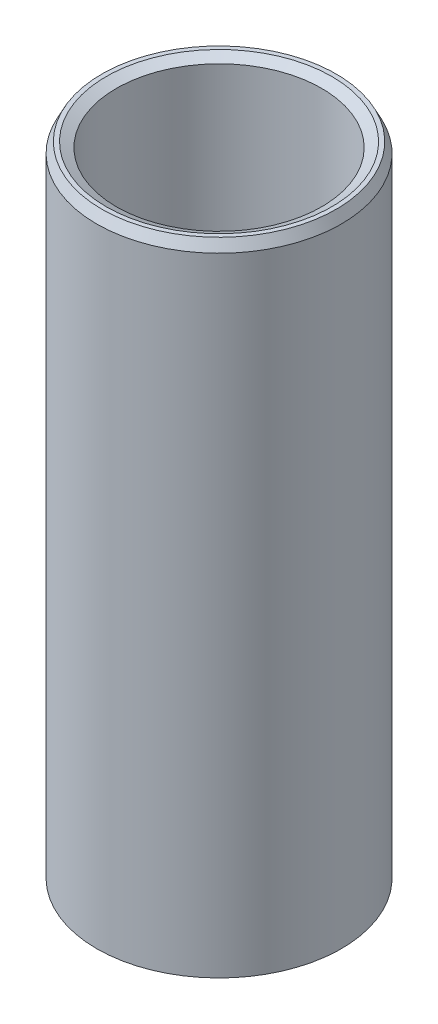
ISO-10303-21;
HEADER;
FILE_DESCRIPTION(('STEP AP214'),'2;1');
FILE_NAME('part.step','',(''),(''),'','','');
FILE_SCHEMA(('AUTOMOTIVE_DESIGN { 1 0 10303 214 1 1 1 1 }'));
ENDSEC;
DATA;
#1=APPLICATION_CONTEXT('core data for automotive mechanical design processes');
#2=APPLICATION_PROTOCOL_DEFINITION('international standard','automotive_design',2000,#1);
#3=PRODUCT_CONTEXT('',#1,'mechanical');
#4=PRODUCT('Part','Part','',(#3));
#5=PRODUCT_RELATED_PRODUCT_CATEGORY('part','',(#4));
#6=PRODUCT_DEFINITION_FORMATION('','',#4);
#7=PRODUCT_DEFINITION_CONTEXT('part definition',#1,'design');
#8=PRODUCT_DEFINITION('design','',#6,#7);
#9=PRODUCT_DEFINITION_SHAPE('','',#8);
#10=(LENGTH_UNIT() NAMED_UNIT(*) SI_UNIT(.MILLI.,.METRE.));
#11=(NAMED_UNIT(*) PLANE_ANGLE_UNIT() SI_UNIT($,.RADIAN.));
#12=(NAMED_UNIT(*) SI_UNIT($,.STERADIAN.) SOLID_ANGLE_UNIT());
#13=UNCERTAINTY_MEASURE_WITH_UNIT(LENGTH_MEASURE(1.E-05),#10,'distance_accuracy_value','');
#14=(GEOMETRIC_REPRESENTATION_CONTEXT(3) GLOBAL_UNCERTAINTY_ASSIGNED_CONTEXT((#13)) GLOBAL_UNIT_ASSIGNED_CONTEXT((#10,
#11,#12)) REPRESENTATION_CONTEXT('',''));
#15=CARTESIAN_POINT('',(0.,0.,0.));
#16=DIRECTION('',(0.,0.,1.));
#17=DIRECTION('',(1.,0.,0.));
#18=AXIS2_PLACEMENT_3D('',#15,#16,#17);
#19=CARTESIAN_POINT('',(0.,118.256648868057,0.));
#20=DIRECTION('',(0.,-1.,0.));
#21=DIRECTION('',(0.,0.,-1.));
#22=AXIS2_PLACEMENT_3D('',#19,#20,#21);
#23=CYLINDRICAL_SURFACE('',#22,22.5);
#24=CARTESIAN_POINT('',(0.,0.947082951923459,0.));
#25=DIRECTION('',(0.,1.,0.));
#26=DIRECTION('',(0.,0.,1.));
#27=AXIS2_PLACEMENT_3D('',#24,#25,#26);
#28=CIRCLE('',#27,22.5);
#29=CARTESIAN_POINT('',(0.,0.947082951923459,22.5));
#30=VERTEX_POINT('',#29);
#31=EDGE_CURVE('E10',#30,#30,#28,.T.);
#32=ORIENTED_EDGE('',*,*,#31,.T.);
#33=EDGE_LOOP('',(#32));
#34=FACE_BOUND('',#33,.T.);
#35=CARTESIAN_POINT('',(0.,116.382410993889,0.));
#36=DIRECTION('',(0.,1.,0.));
#37=DIRECTION('',(0.,0.,1.));
#38=AXIS2_PLACEMENT_3D('',#35,#36,#37);
#39=CIRCLE('',#38,22.5);
#40=CARTESIAN_POINT('',(0.,116.382410993889,22.5));
#41=VERTEX_POINT('',#40);
#42=EDGE_CURVE('E50',#41,#41,#39,.F.);
#43=ORIENTED_EDGE('',*,*,#42,.T.);
#44=EDGE_LOOP('',(#43));
#45=FACE_BOUND('',#44,.T.);
#46=ADVANCED_FACE('F39',(#34,#45),#23,.T.);
#47=CARTESIAN_POINT('',(0.,118.256648868057,0.));
#48=DIRECTION('',(0.,1.,0.));
#49=DIRECTION('',(0.,0.,1.));
#50=AXIS2_PLACEMENT_3D('',#47,#48,#49);
#51=PLANE('',#50);
#52=CARTESIAN_POINT('',(0.,118.256648868057,0.));
#53=DIRECTION('',(0.,1.,0.));
#54=DIRECTION('',(0.,0.,1.));
#55=AXIS2_PLACEMENT_3D('',#52,#53,#54);
#56=CIRCLE('',#55,20.7517110428833);
#57=CARTESIAN_POINT('',(0.,118.256648868057,20.7517110428833));
#58=VERTEX_POINT('',#57);
#59=EDGE_CURVE('E58',#58,#58,#56,.F.);
#60=ORIENTED_EDGE('',*,*,#59,.T.);
#61=EDGE_LOOP('',(#60));
#62=FACE_BOUND('',#61,.T.);
#63=CARTESIAN_POINT('',(0.,118.256648868057,0.));
#64=DIRECTION('',(0.,1.,0.));
#65=DIRECTION('',(0.,0.,1.));
#66=AXIS2_PLACEMENT_3D('',#63,#64,#65);
#67=CIRCLE('',#66,21.5529170480766);
#68=CARTESIAN_POINT('',(0.,118.256648868057,21.5529170480766));
#69=VERTEX_POINT('',#68);
#70=EDGE_CURVE('E61',#69,#69,#67,.T.);
#71=ORIENTED_EDGE('',*,*,#70,.T.);
#72=EDGE_LOOP('',(#71));
#73=FACE_BOUND('',#72,.T.);
#74=ADVANCED_FACE('F88',(#62,#73),#51,.T.);
#75=CARTESIAN_POINT('',(0.,0.,0.));
#76=DIRECTION('',(0.,1.,0.));
#77=DIRECTION('',(0.,0.,1.));
#78=AXIS2_PLACEMENT_3D('',#75,#76,#77);
#79=PLANE('',#78);
#80=CARTESIAN_POINT('',(0.,0.,0.));
#81=DIRECTION('',(0.,1.,0.));
#82=DIRECTION('',(0.,0.,1.));
#83=AXIS2_PLACEMENT_3D('',#80,#81,#82);
#84=CIRCLE('',#83,19.8245561206393);
#85=CARTESIAN_POINT('',(0.,0.,19.8245561206393));
#86=VERTEX_POINT('',#85);
#87=EDGE_CURVE('E51',#86,#86,#84,.T.);
#88=ORIENTED_EDGE('',*,*,#87,.T.);
#89=EDGE_LOOP('',(#88));
#90=FACE_BOUND('',#89,.T.);
#91=CARTESIAN_POINT('',(0.,0.,0.));
#92=DIRECTION('',(0.,1.,0.));
#93=DIRECTION('',(0.,0.,1.));
#94=AXIS2_PLACEMENT_3D('',#91,#92,#93);
#95=CIRCLE('',#94,20.6257621258325);
#96=CARTESIAN_POINT('',(0.,0.,20.6257621258325));
#97=VERTEX_POINT('',#96);
#98=EDGE_CURVE('E54',#97,#97,#95,.F.);
#99=ORIENTED_EDGE('',*,*,#98,.T.);
#100=EDGE_LOOP('',(#99));
#101=FACE_BOUND('',#100,.T.);
#102=ADVANCED_FACE('F83',(#90,#101),#79,.F.);
#103=CARTESIAN_POINT('',(0.,118.256648868057,0.));
#104=DIRECTION('',(0.,-1.,0.));
#105=DIRECTION('',(0.,0.,-1.));
#106=AXIS2_PLACEMENT_3D('',#103,#104,#105);
#107=CYLINDRICAL_SURFACE('',#106,18.8774731687159);
#108=CARTESIAN_POINT('',(0.,117.309565916133,0.));
#109=DIRECTION('',(0.,1.,0.));
#110=DIRECTION('',(0.,0.,1.));
#111=AXIS2_PLACEMENT_3D('',#108,#109,#110);
#112=CIRCLE('',#111,18.8774731687159);
#113=CARTESIAN_POINT('',(0.,117.309565916133,18.8774731687159));
#114=VERTEX_POINT('',#113);
#115=EDGE_CURVE('E67',#114,#114,#112,.T.);
#116=ORIENTED_EDGE('',*,*,#115,.T.);
#117=EDGE_LOOP('',(#116));
#118=FACE_BOUND('',#117,.T.);
#119=CARTESIAN_POINT('',(0.,1.8742378741675,0.));
#120=DIRECTION('',(0.,1.,0.));
#121=DIRECTION('',(0.,0.,1.));
#122=AXIS2_PLACEMENT_3D('',#119,#120,#121);
#123=CIRCLE('',#122,18.8774731687159);
#124=CARTESIAN_POINT('',(0.,1.8742378741675,18.8774731687159));
#125=VERTEX_POINT('',#124);
#126=EDGE_CURVE('E69',#125,#125,#123,.F.);
#127=ORIENTED_EDGE('',*,*,#126,.T.);
#128=EDGE_LOOP('',(#127));
#129=FACE_BOUND('',#128,.T.);
#130=ADVANCED_FACE('F71',(#118,#129),#107,.F.);
#131=CARTESIAN_POINT('',(0.,117.309565916133,0.));
#132=DIRECTION('',(0.,1.,0.));
#133=DIRECTION('',(0.,0.,1.));
#134=AXIS2_PLACEMENT_3D('',#131,#132,#133);
#135=CONICAL_SURFACE('',#134,18.8774731687159,1.10290472654469);
#136=ORIENTED_EDGE('',*,*,#59,.F.);
#137=EDGE_LOOP('',(#136));
#138=FACE_BOUND('',#137,.T.);
#139=ORIENTED_EDGE('',*,*,#115,.F.);
#140=EDGE_LOOP('',(#139));
#141=FACE_BOUND('',#140,.T.);
#142=ADVANCED_FACE('F77',(#138,#141),#135,.F.);
#143=CARTESIAN_POINT('',(0.,0.,0.));
#144=DIRECTION('',(0.,-1.,0.));
#145=DIRECTION('',(0.,0.,-1.));
#146=AXIS2_PLACEMENT_3D('',#143,#144,#145);
#147=CONICAL_SURFACE('',#146,19.8245561206393,0.467891600250206);
#148=ORIENTED_EDGE('',*,*,#126,.F.);
#149=EDGE_LOOP('',(#148));
#150=FACE_BOUND('',#149,.T.);
#151=ORIENTED_EDGE('',*,*,#87,.F.);
#152=EDGE_LOOP('',(#151));
#153=FACE_BOUND('',#152,.T.);
#154=ADVANCED_FACE('F73',(#150,#153),#147,.F.);
#155=CARTESIAN_POINT('',(0.,0.947082951923459,0.));
#156=DIRECTION('',(0.,1.,0.));
#157=DIRECTION('',(0.,0.,1.));
#158=AXIS2_PLACEMENT_3D('',#155,#156,#157);
#159=CONICAL_SURFACE('',#158,22.5,1.10290472654469);
#160=ORIENTED_EDGE('',*,*,#98,.F.);
#161=EDGE_LOOP('',(#160));
#162=FACE_BOUND('',#161,.T.);
#163=ORIENTED_EDGE('',*,*,#31,.F.);
#164=EDGE_LOOP('',(#163));
#165=FACE_BOUND('',#164,.T.);
#166=ADVANCED_FACE('F76',(#162,#165),#159,.T.);
#167=CARTESIAN_POINT('',(0.,118.256648868057,0.));
#168=DIRECTION('',(0.,-1.,0.));
#169=DIRECTION('',(0.,0.,-1.));
#170=AXIS2_PLACEMENT_3D('',#167,#168,#169);
#171=CONICAL_SURFACE('',#170,21.5529170480766,0.467891600250205);
#172=ORIENTED_EDGE('',*,*,#42,.F.);
#173=EDGE_LOOP('',(#172));
#174=FACE_BOUND('',#173,.T.);
#175=ORIENTED_EDGE('',*,*,#70,.F.);
#176=EDGE_LOOP('',(#175));
#177=FACE_BOUND('',#176,.T.);
#178=ADVANCED_FACE('F45',(#174,#177),#171,.T.);
#179=CLOSED_SHELL('',(#46,#74,#102,#130,#142,#154,#166,#178));
#180=MANIFOLD_SOLID_BREP('B2',#179);
#181=ADVANCED_BREP_SHAPE_REPRESENTATION('',(#18,#180),#14);
#182=SHAPE_DEFINITION_REPRESENTATION(#9,#181);
ENDSEC;
END-ISO-10303-21;
